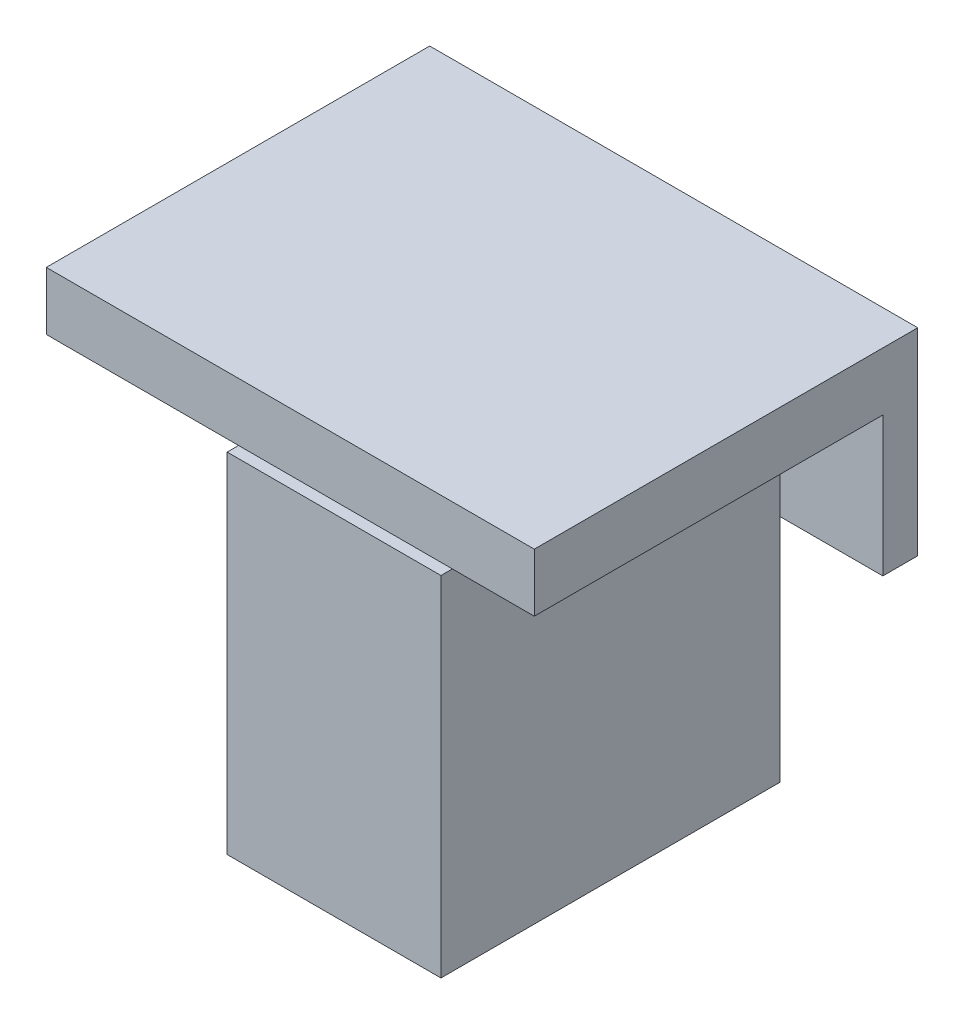
ISO-10303-21;
HEADER;
FILE_DESCRIPTION(('STEP AP214'),'2;1');
FILE_NAME('part.step','',(''),(''),'','','');
FILE_SCHEMA(('AUTOMOTIVE_DESIGN { 1 0 10303 214 1 1 1 1 }'));
ENDSEC;
DATA;
#1=APPLICATION_CONTEXT('core data for automotive mechanical design processes');
#2=APPLICATION_PROTOCOL_DEFINITION('international standard','automotive_design',2000,#1);
#3=PRODUCT_CONTEXT('',#1,'mechanical');
#4=PRODUCT('Part','Part','',(#3));
#5=PRODUCT_RELATED_PRODUCT_CATEGORY('part','',(#4));
#6=PRODUCT_DEFINITION_FORMATION('','',#4);
#7=PRODUCT_DEFINITION_CONTEXT('part definition',#1,'design');
#8=PRODUCT_DEFINITION('design','',#6,#7);
#9=PRODUCT_DEFINITION_SHAPE('','',#8);
#10=(LENGTH_UNIT() NAMED_UNIT(*) SI_UNIT(.MILLI.,.METRE.));
#11=(NAMED_UNIT(*) PLANE_ANGLE_UNIT() SI_UNIT($,.RADIAN.));
#12=(NAMED_UNIT(*) SI_UNIT($,.STERADIAN.) SOLID_ANGLE_UNIT());
#13=UNCERTAINTY_MEASURE_WITH_UNIT(LENGTH_MEASURE(1.E-05),#10,'distance_accuracy_value','');
#14=(GEOMETRIC_REPRESENTATION_CONTEXT(3) GLOBAL_UNCERTAINTY_ASSIGNED_CONTEXT((#13)) GLOBAL_UNIT_ASSIGNED_CONTEXT((#10,
#11,#12)) REPRESENTATION_CONTEXT('',''));
#15=CARTESIAN_POINT('',(0.,0.,0.));
#16=DIRECTION('',(0.,0.,1.));
#17=DIRECTION('',(1.,0.,0.));
#18=AXIS2_PLACEMENT_3D('',#15,#16,#17);
#19=CARTESIAN_POINT('',(42.,-5.,33.));
#20=DIRECTION('',(0.,1.,0.));
#21=DIRECTION('',(-1.,0.,0.));
#22=AXIS2_PLACEMENT_3D('',#19,#20,#21);
#23=PLANE('',#22);
#24=DIRECTION('',(0.,0.,1.));
#25=VECTOR('',#24,1.);
#26=CARTESIAN_POINT('',(34.9498285382595,-5.,4.78266874465594));
#27=LINE('',#26,#25);
#28=CARTESIAN_POINT('',(34.9498285382595,-5.,4.78266874465594));
#29=VERTEX_POINT('',#28);
#30=CARTESIAN_POINT('',(34.9498285382595,-5.,33.));
#31=VERTEX_POINT('',#30);
#32=EDGE_CURVE('E58',#29,#31,#27,.T.);
#33=ORIENTED_EDGE('',*,*,#32,.F.);
#34=DIRECTION('',(1.,0.,0.));
#35=VECTOR('',#34,1.);
#36=CARTESIAN_POINT('',(34.9498285382595,-5.,4.78266874465594));
#37=LINE('',#36,#35);
#38=CARTESIAN_POINT('',(16.5498285382595,-5.,4.78266874465594));
#39=VERTEX_POINT('',#38);
#40=EDGE_CURVE('E188',#39,#29,#37,.T.);
#41=ORIENTED_EDGE('',*,*,#40,.F.);
#42=DIRECTION('',(0.,0.,-1.));
#43=VECTOR('',#42,1.);
#44=CARTESIAN_POINT('',(16.5498285382595,-5.,4.78266874465594));
#45=LINE('',#44,#43);
#46=CARTESIAN_POINT('',(16.5498285382595,-5.,33.));
#47=VERTEX_POINT('',#46);
#48=EDGE_CURVE('E198',#47,#39,#45,.T.);
#49=ORIENTED_EDGE('',*,*,#48,.F.);
#50=DIRECTION('',(1.,0.,0.));
#51=VECTOR('',#50,1.);
#52=CARTESIAN_POINT('',(42.,-5.,33.));
#53=LINE('',#52,#51);
#54=CARTESIAN_POINT('',(0.,-5.00000000000001,33.));
#55=VERTEX_POINT('',#54);
#56=EDGE_CURVE('E223',#55,#47,#53,.T.);
#57=ORIENTED_EDGE('',*,*,#56,.F.);
#58=DIRECTION('',(0.,0.,-1.));
#59=VECTOR('',#58,1.);
#60=CARTESIAN_POINT('',(0.,-5.00000000000001,33.));
#61=LINE('',#60,#59);
#62=CARTESIAN_POINT('',(0.,-5.,3.));
#63=VERTEX_POINT('',#62);
#64=EDGE_CURVE('E232',#55,#63,#61,.T.);
#65=ORIENTED_EDGE('',*,*,#64,.T.);
#66=DIRECTION('',(1.,0.,0.));
#67=VECTOR('',#66,1.);
#68=CARTESIAN_POINT('',(42.,-5.,3.));
#69=LINE('',#68,#67);
#70=CARTESIAN_POINT('',(42.,-5.,3.));
#71=VERTEX_POINT('',#70);
#72=EDGE_CURVE('E213',#63,#71,#69,.T.);
#73=ORIENTED_EDGE('',*,*,#72,.T.);
#74=DIRECTION('',(0.,0.,-1.));
#75=VECTOR('',#74,1.);
#76=CARTESIAN_POINT('',(42.,-5.,33.));
#77=LINE('',#76,#75);
#78=CARTESIAN_POINT('',(42.,-5.,33.));
#79=VERTEX_POINT('',#78);
#80=EDGE_CURVE('E226',#79,#71,#77,.T.);
#81=ORIENTED_EDGE('',*,*,#80,.F.);
#82=EDGE_CURVE('E222',#31,#79,#53,.T.);
#83=ORIENTED_EDGE('',*,*,#82,.F.);
#84=EDGE_LOOP('',(#33,#41,#49,#57,#65,#73,#81,#83));
#85=FACE_BOUND('',#84,.T.);
#86=ADVANCED_FACE('F35',(#85),#23,.F.);
#87=CARTESIAN_POINT('',(0.,0.,3.));
#88=DIRECTION('',(1.,0.,0.));
#89=DIRECTION('',(0.,1.,0.));
#90=AXIS2_PLACEMENT_3D('',#87,#88,#89);
#91=PLANE('',#90);
#92=DIRECTION('',(0.,-1.,0.));
#93=VECTOR('',#92,1.);
#94=CARTESIAN_POINT('',(0.,0.,0.));
#95=LINE('',#94,#93);
#96=CARTESIAN_POINT('',(0.,0.,0.));
#97=VERTEX_POINT('',#96);
#98=CARTESIAN_POINT('',(0.,-17.,0.));
#99=VERTEX_POINT('',#98);
#100=EDGE_CURVE('E239',#97,#99,#95,.T.);
#101=ORIENTED_EDGE('',*,*,#100,.T.);
#102=DIRECTION('',(0.,0.,-1.));
#103=VECTOR('',#102,1.);
#104=CARTESIAN_POINT('',(0.,-17.,3.));
#105=LINE('',#104,#103);
#106=CARTESIAN_POINT('',(0.,-17.,3.));
#107=VERTEX_POINT('',#106);
#108=EDGE_CURVE('E11',#107,#99,#105,.T.);
#109=ORIENTED_EDGE('',*,*,#108,.F.);
#110=DIRECTION('',(0.,-1.,0.));
#111=VECTOR('',#110,1.);
#112=CARTESIAN_POINT('',(0.,0.,3.));
#113=LINE('',#112,#111);
#114=EDGE_CURVE('E248',#63,#107,#113,.T.);
#115=ORIENTED_EDGE('',*,*,#114,.F.);
#116=ORIENTED_EDGE('',*,*,#64,.F.);
#117=DIRECTION('',(0.,-1.,0.));
#118=VECTOR('',#117,1.);
#119=CARTESIAN_POINT('',(0.,0.,33.));
#120=LINE('',#119,#118);
#121=CARTESIAN_POINT('',(0.,0.,33.));
#122=VERTEX_POINT('',#121);
#123=EDGE_CURVE('E220',#122,#55,#120,.T.);
#124=ORIENTED_EDGE('',*,*,#123,.F.);
#125=DIRECTION('',(0.,0.,-1.));
#126=VECTOR('',#125,1.);
#127=CARTESIAN_POINT('',(0.,0.,3.));
#128=LINE('',#127,#126);
#129=EDGE_CURVE('E255',#122,#97,#128,.T.);
#130=ORIENTED_EDGE('',*,*,#129,.T.);
#131=EDGE_LOOP('',(#101,#109,#115,#116,#124,#130));
#132=FACE_BOUND('',#131,.T.);
#133=ADVANCED_FACE('F37',(#132),#91,.F.);
#134=CARTESIAN_POINT('',(0.,-17.,3.));
#135=DIRECTION('',(0.,1.,0.));
#136=DIRECTION('',(0.,0.,1.));
#137=AXIS2_PLACEMENT_3D('',#134,#135,#136);
#138=PLANE('',#137);
#139=DIRECTION('',(1.,0.,0.));
#140=VECTOR('',#139,1.);
#141=CARTESIAN_POINT('',(0.,-17.,0.));
#142=LINE('',#141,#140);
#143=CARTESIAN_POINT('',(42.,-17.,0.));
#144=VERTEX_POINT('',#143);
#145=EDGE_CURVE('E258',#99,#144,#142,.T.);
#146=ORIENTED_EDGE('',*,*,#145,.T.);
#147=DIRECTION('',(0.,0.,-1.));
#148=VECTOR('',#147,1.);
#149=CARTESIAN_POINT('',(42.,-17.,3.));
#150=LINE('',#149,#148);
#151=CARTESIAN_POINT('',(42.,-17.,3.));
#152=VERTEX_POINT('',#151);
#153=EDGE_CURVE('E43',#152,#144,#150,.T.);
#154=ORIENTED_EDGE('',*,*,#153,.F.);
#155=DIRECTION('',(1.,0.,0.));
#156=VECTOR('',#155,1.);
#157=CARTESIAN_POINT('',(0.,-17.,3.));
#158=LINE('',#157,#156);
#159=EDGE_CURVE('E250',#107,#152,#158,.T.);
#160=ORIENTED_EDGE('',*,*,#159,.F.);
#161=ORIENTED_EDGE('',*,*,#108,.T.);
#162=EDGE_LOOP('',(#146,#154,#160,#161));
#163=FACE_BOUND('',#162,.T.);
#164=ADVANCED_FACE('F298',(#163),#138,.F.);
#165=CARTESIAN_POINT('',(42.,0.,3.));
#166=DIRECTION('',(-1.,0.,0.));
#167=DIRECTION('',(0.,-1.,0.));
#168=AXIS2_PLACEMENT_3D('',#165,#166,#167);
#169=PLANE('',#168);
#170=DIRECTION('',(0.,1.,0.));
#171=VECTOR('',#170,1.);
#172=CARTESIAN_POINT('',(42.,0.,0.));
#173=LINE('',#172,#171);
#174=CARTESIAN_POINT('',(42.,0.,0.));
#175=VERTEX_POINT('',#174);
#176=EDGE_CURVE('E260',#144,#175,#173,.T.);
#177=ORIENTED_EDGE('',*,*,#176,.T.);
#178=DIRECTION('',(0.,0.,-1.));
#179=VECTOR('',#178,1.);
#180=CARTESIAN_POINT('',(42.,0.,3.));
#181=LINE('',#180,#179);
#182=CARTESIAN_POINT('',(42.,0.,33.));
#183=VERTEX_POINT('',#182);
#184=EDGE_CURVE('E265',#183,#175,#181,.T.);
#185=ORIENTED_EDGE('',*,*,#184,.F.);
#186=DIRECTION('',(0.,1.,0.));
#187=VECTOR('',#186,1.);
#188=CARTESIAN_POINT('',(42.,0.,33.));
#189=LINE('',#188,#187);
#190=EDGE_CURVE('E214',#79,#183,#189,.T.);
#191=ORIENTED_EDGE('',*,*,#190,.F.);
#192=ORIENTED_EDGE('',*,*,#80,.T.);
#193=DIRECTION('',(0.,1.,0.));
#194=VECTOR('',#193,1.);
#195=CARTESIAN_POINT('',(42.,0.,3.));
#196=LINE('',#195,#194);
#197=EDGE_CURVE('E253',#152,#71,#196,.T.);
#198=ORIENTED_EDGE('',*,*,#197,.F.);
#199=ORIENTED_EDGE('',*,*,#153,.T.);
#200=EDGE_LOOP('',(#177,#185,#191,#192,#198,#199));
#201=FACE_BOUND('',#200,.T.);
#202=ADVANCED_FACE('F272',(#201),#169,.F.);
#203=CARTESIAN_POINT('',(0.,0.,3.));
#204=DIRECTION('',(0.,-1.,0.));
#205=DIRECTION('',(0.,0.,-1.));
#206=AXIS2_PLACEMENT_3D('',#203,#204,#205);
#207=PLANE('',#206);
#208=DIRECTION('',(-1.,0.,0.));
#209=VECTOR('',#208,1.);
#210=CARTESIAN_POINT('',(0.,0.,0.));
#211=LINE('',#210,#209);
#212=EDGE_CURVE('E251',#175,#97,#211,.T.);
#213=ORIENTED_EDGE('',*,*,#212,.T.);
#214=ORIENTED_EDGE('',*,*,#129,.F.);
#215=DIRECTION('',(-1.,0.,0.));
#216=VECTOR('',#215,1.);
#217=CARTESIAN_POINT('',(42.,0.,33.));
#218=LINE('',#217,#216);
#219=EDGE_CURVE('E217',#183,#122,#218,.T.);
#220=ORIENTED_EDGE('',*,*,#219,.F.);
#221=ORIENTED_EDGE('',*,*,#184,.T.);
#222=EDGE_LOOP('',(#213,#214,#220,#221));
#223=FACE_BOUND('',#222,.T.);
#224=ADVANCED_FACE('F280',(#223),#207,.F.);
#225=CARTESIAN_POINT('',(0.,0.,3.));
#226=DIRECTION('',(0.,0.,1.));
#227=DIRECTION('',(1.,0.,0.));
#228=AXIS2_PLACEMENT_3D('',#225,#226,#227);
#229=PLANE('',#228);
#230=ORIENTED_EDGE('',*,*,#72,.F.);
#231=ORIENTED_EDGE('',*,*,#114,.T.);
#232=ORIENTED_EDGE('',*,*,#159,.T.);
#233=ORIENTED_EDGE('',*,*,#197,.T.);
#234=EDGE_LOOP('',(#230,#231,#232,#233));
#235=FACE_BOUND('',#234,.T.);
#236=CARTESIAN_POINT('',(6.,-8.5,3.));
#237=DIRECTION('',(0.,0.,1.));
#238=DIRECTION('',(1.,0.,0.));
#239=AXIS2_PLACEMENT_3D('',#236,#237,#238);
#240=CIRCLE('',#239,1.625);
#241=CARTESIAN_POINT('',(7.625,-8.5,3.));
#242=VERTEX_POINT('',#241);
#243=EDGE_CURVE('E240',#242,#242,#240,.T.);
#244=ORIENTED_EDGE('',*,*,#243,.F.);
#245=EDGE_LOOP('',(#244));
#246=FACE_BOUND('',#245,.T.);
#247=CARTESIAN_POINT('',(36.,-8.5,3.));
#248=DIRECTION('',(0.,0.,1.));
#249=DIRECTION('',(1.,0.,0.));
#250=AXIS2_PLACEMENT_3D('',#247,#248,#249);
#251=CIRCLE('',#250,1.625);
#252=CARTESIAN_POINT('',(37.625,-8.5,3.));
#253=VERTEX_POINT('',#252);
#254=EDGE_CURVE('E235',#253,#253,#251,.T.);
#255=ORIENTED_EDGE('',*,*,#254,.F.);
#256=EDGE_LOOP('',(#255));
#257=FACE_BOUND('',#256,.T.);
#258=ADVANCED_FACE('F296',(#235,#246,#257),#229,.T.);
#259=CARTESIAN_POINT('',(0.,0.,0.));
#260=DIRECTION('',(0.,0.,1.));
#261=DIRECTION('',(1.,0.,0.));
#262=AXIS2_PLACEMENT_3D('',#259,#260,#261);
#263=PLANE('',#262);
#264=CARTESIAN_POINT('',(6.,-8.5,0.));
#265=DIRECTION('',(0.,0.,1.));
#266=DIRECTION('',(1.,0.,0.));
#267=AXIS2_PLACEMENT_3D('',#264,#265,#266);
#268=CIRCLE('',#267,1.625);
#269=CARTESIAN_POINT('',(7.625,-8.5,0.));
#270=VERTEX_POINT('',#269);
#271=EDGE_CURVE('E236',#270,#270,#268,.T.);
#272=ORIENTED_EDGE('',*,*,#271,.T.);
#273=EDGE_LOOP('',(#272));
#274=FACE_BOUND('',#273,.T.);
#275=CARTESIAN_POINT('',(36.,-8.5,0.));
#276=DIRECTION('',(0.,0.,1.));
#277=DIRECTION('',(1.,0.,0.));
#278=AXIS2_PLACEMENT_3D('',#275,#276,#277);
#279=CIRCLE('',#278,1.625);
#280=CARTESIAN_POINT('',(37.625,-8.5,0.));
#281=VERTEX_POINT('',#280);
#282=EDGE_CURVE('E243',#281,#281,#279,.T.);
#283=ORIENTED_EDGE('',*,*,#282,.T.);
#284=EDGE_LOOP('',(#283));
#285=FACE_BOUND('',#284,.T.);
#286=ORIENTED_EDGE('',*,*,#100,.F.);
#287=ORIENTED_EDGE('',*,*,#212,.F.);
#288=ORIENTED_EDGE('',*,*,#176,.F.);
#289=ORIENTED_EDGE('',*,*,#145,.F.);
#290=EDGE_LOOP('',(#286,#287,#288,#289));
#291=FACE_BOUND('',#290,.T.);
#292=ADVANCED_FACE('F278',(#274,#285,#291),#263,.F.);
#293=CARTESIAN_POINT('',(36.,-8.5,0.));
#294=DIRECTION('',(0.,0.,1.));
#295=DIRECTION('',(1.,0.,0.));
#296=AXIS2_PLACEMENT_3D('',#293,#294,#295);
#297=CYLINDRICAL_SURFACE('',#296,1.625);
#298=ORIENTED_EDGE('',*,*,#282,.F.);
#299=EDGE_LOOP('',(#298));
#300=FACE_BOUND('',#299,.T.);
#301=ORIENTED_EDGE('',*,*,#254,.T.);
#302=EDGE_LOOP('',(#301));
#303=FACE_BOUND('',#302,.T.);
#304=ADVANCED_FACE('F357',(#300,#303),#297,.F.);
#305=CARTESIAN_POINT('',(6.,-8.5,0.));
#306=DIRECTION('',(0.,0.,1.));
#307=DIRECTION('',(1.,0.,0.));
#308=AXIS2_PLACEMENT_3D('',#305,#306,#307);
#309=CYLINDRICAL_SURFACE('',#308,1.625);
#310=ORIENTED_EDGE('',*,*,#271,.F.);
#311=EDGE_LOOP('',(#310));
#312=FACE_BOUND('',#311,.T.);
#313=ORIENTED_EDGE('',*,*,#243,.T.);
#314=EDGE_LOOP('',(#313));
#315=FACE_BOUND('',#314,.T.);
#316=ADVANCED_FACE('F353',(#312,#315),#309,.F.);
#317=CARTESIAN_POINT('',(0.,0.,33.));
#318=DIRECTION('',(0.,0.,-1.));
#319=DIRECTION('',(-1.,0.,0.));
#320=AXIS2_PLACEMENT_3D('',#317,#318,#319);
#321=PLANE('',#320);
#322=ORIENTED_EDGE('',*,*,#190,.T.);
#323=ORIENTED_EDGE('',*,*,#219,.T.);
#324=ORIENTED_EDGE('',*,*,#123,.T.);
#325=ORIENTED_EDGE('',*,*,#56,.T.);
#326=EDGE_CURVE('E227',#47,#31,#53,.T.);
#327=ORIENTED_EDGE('',*,*,#326,.T.);
#328=ORIENTED_EDGE('',*,*,#82,.T.);
#329=EDGE_LOOP('',(#322,#323,#324,#325,#327,#328));
#330=FACE_BOUND('',#329,.T.);
#331=ADVANCED_FACE('F289',(#330),#321,.F.);
#332=CARTESIAN_POINT('',(0.,-5.00000000000001,0.));
#333=DIRECTION('',(0.,-1.,0.));
#334=DIRECTION('',(1.,0.,0.));
#335=AXIS2_PLACEMENT_3D('',#332,#333,#334);
#336=PLANE('',#335);
#337=CARTESIAN_POINT('',(34.9498285382595,-5.,33.9826687446559));
#338=VERTEX_POINT('',#337);
#339=EDGE_CURVE('E160',#31,#338,#27,.T.);
#340=ORIENTED_EDGE('',*,*,#339,.F.);
#341=ORIENTED_EDGE('',*,*,#326,.F.);
#342=CARTESIAN_POINT('',(16.5498285382595,-5.,33.9826687446559));
#343=VERTEX_POINT('',#342);
#344=EDGE_CURVE('E199',#343,#47,#45,.T.);
#345=ORIENTED_EDGE('',*,*,#344,.F.);
#346=DIRECTION('',(-1.,0.,0.));
#347=VECTOR('',#346,1.);
#348=CARTESIAN_POINT('',(34.9498285382595,-5.,33.9826687446559));
#349=LINE('',#348,#347);
#350=EDGE_CURVE('E196',#338,#343,#349,.T.);
#351=ORIENTED_EDGE('',*,*,#350,.F.);
#352=EDGE_LOOP('',(#340,#341,#345,#351));
#353=FACE_BOUND('',#352,.T.);
#354=ADVANCED_FACE('F335',(#353),#336,.F.);
#355=CARTESIAN_POINT('',(0.,-35.,0.));
#356=DIRECTION('',(0.,-1.,0.));
#357=DIRECTION('',(1.,0.,0.));
#358=AXIS2_PLACEMENT_3D('',#355,#356,#357);
#359=PLANE('',#358);
#360=DIRECTION('',(0.,0.,1.));
#361=VECTOR('',#360,1.);
#362=CARTESIAN_POINT('',(34.9498285382595,-35.,4.78266874465594));
#363=LINE('',#362,#361);
#364=CARTESIAN_POINT('',(34.9498285382595,-35.,4.78266874465594));
#365=VERTEX_POINT('',#364);
#366=CARTESIAN_POINT('',(34.9498285382595,-35.,33.9826687446559));
#367=VERTEX_POINT('',#366);
#368=EDGE_CURVE('E184',#365,#367,#363,.T.);
#369=ORIENTED_EDGE('',*,*,#368,.T.);
#370=DIRECTION('',(-1.,0.,0.));
#371=VECTOR('',#370,1.);
#372=CARTESIAN_POINT('',(34.9498285382595,-35.,33.9826687446559));
#373=LINE('',#372,#371);
#374=CARTESIAN_POINT('',(16.5498285382595,-35.,33.9826687446559));
#375=VERTEX_POINT('',#374);
#376=EDGE_CURVE('E187',#367,#375,#373,.T.);
#377=ORIENTED_EDGE('',*,*,#376,.T.);
#378=DIRECTION('',(0.,0.,-1.));
#379=VECTOR('',#378,1.);
#380=CARTESIAN_POINT('',(16.5498285382595,-35.,4.78266874465594));
#381=LINE('',#380,#379);
#382=CARTESIAN_POINT('',(16.5498285382595,-35.,4.78266874465594));
#383=VERTEX_POINT('',#382);
#384=EDGE_CURVE('E190',#375,#383,#381,.T.);
#385=ORIENTED_EDGE('',*,*,#384,.T.);
#386=DIRECTION('',(1.,0.,0.));
#387=VECTOR('',#386,1.);
#388=CARTESIAN_POINT('',(34.9498285382595,-35.,4.78266874465594));
#389=LINE('',#388,#387);
#390=EDGE_CURVE('E192',#383,#365,#389,.T.);
#391=ORIENTED_EDGE('',*,*,#390,.T.);
#392=EDGE_LOOP('',(#369,#377,#385,#391));
#393=FACE_BOUND('',#392,.T.);
#394=DIRECTION('',(-1.,0.,0.));
#395=VECTOR('',#394,1.);
#396=CARTESIAN_POINT('',(31.9498285382595,-35.,30.9826687446559));
#397=LINE('',#396,#395);
#398=CARTESIAN_POINT('',(31.9498285382595,-35.,30.9826687446559));
#399=VERTEX_POINT('',#398);
#400=CARTESIAN_POINT('',(19.5498285382595,-35.,30.9826687446559));
#401=VERTEX_POINT('',#400);
#402=EDGE_CURVE('E152',#399,#401,#397,.T.);
#403=ORIENTED_EDGE('',*,*,#402,.F.);
#404=DIRECTION('',(0.,0.,1.));
#405=VECTOR('',#404,1.);
#406=CARTESIAN_POINT('',(31.9498285382595,-35.,7.78266874465594));
#407=LINE('',#406,#405);
#408=CARTESIAN_POINT('',(31.9498285382595,-35.,7.78266874465594));
#409=VERTEX_POINT('',#408);
#410=EDGE_CURVE('E144',#409,#399,#407,.T.);
#411=ORIENTED_EDGE('',*,*,#410,.F.);
#412=DIRECTION('',(1.,0.,0.));
#413=VECTOR('',#412,1.);
#414=CARTESIAN_POINT('',(31.9498285382595,-35.,7.78266874465594));
#415=LINE('',#414,#413);
#416=CARTESIAN_POINT('',(19.5498285382594,-35.,7.78266874465594));
#417=VERTEX_POINT('',#416);
#418=EDGE_CURVE('E168',#417,#409,#415,.T.);
#419=ORIENTED_EDGE('',*,*,#418,.F.);
#420=DIRECTION('',(0.,0.,-1.));
#421=VECTOR('',#420,1.);
#422=CARTESIAN_POINT('',(19.5498285382595,-35.,7.78266874465594));
#423=LINE('',#422,#421);
#424=EDGE_CURVE('E166',#401,#417,#423,.T.);
#425=ORIENTED_EDGE('',*,*,#424,.F.);
#426=EDGE_LOOP('',(#403,#411,#419,#425));
#427=FACE_BOUND('',#426,.T.);
#428=ADVANCED_FACE('F164',(#393,#427),#359,.T.);
#429=CARTESIAN_POINT('',(34.9498285382595,-35.,4.78266874465594));
#430=DIRECTION('',(-1.,0.,0.));
#431=DIRECTION('',(0.,-1.,0.));
#432=AXIS2_PLACEMENT_3D('',#429,#430,#431);
#433=PLANE('',#432);
#434=ORIENTED_EDGE('',*,*,#32,.T.);
#435=ORIENTED_EDGE('',*,*,#339,.T.);
#436=DIRECTION('',(0.,1.,0.));
#437=VECTOR('',#436,1.);
#438=CARTESIAN_POINT('',(34.9498285382595,-35.,33.9826687446559));
#439=LINE('',#438,#437);
#440=EDGE_CURVE('E210',#367,#338,#439,.T.);
#441=ORIENTED_EDGE('',*,*,#440,.F.);
#442=ORIENTED_EDGE('',*,*,#368,.F.);
#443=DIRECTION('',(0.,1.,0.));
#444=VECTOR('',#443,1.);
#445=CARTESIAN_POINT('',(34.9498285382595,-35.,4.78266874465594));
#446=LINE('',#445,#444);
#447=EDGE_CURVE('E194',#365,#29,#446,.T.);
#448=ORIENTED_EDGE('',*,*,#447,.T.);
#449=EDGE_LOOP('',(#434,#435,#441,#442,#448));
#450=FACE_BOUND('',#449,.T.);
#451=ADVANCED_FACE('F334',(#450),#433,.F.);
#452=CARTESIAN_POINT('',(34.9498285382595,-35.,33.9826687446559));
#453=DIRECTION('',(0.,0.,-1.));
#454=DIRECTION('',(-1.,0.,0.));
#455=AXIS2_PLACEMENT_3D('',#452,#453,#454);
#456=PLANE('',#455);
#457=ORIENTED_EDGE('',*,*,#350,.T.);
#458=DIRECTION('',(0.,1.,0.));
#459=VECTOR('',#458,1.);
#460=CARTESIAN_POINT('',(16.5498285382595,-35.,33.9826687446559));
#461=LINE('',#460,#459);
#462=EDGE_CURVE('E207',#375,#343,#461,.T.);
#463=ORIENTED_EDGE('',*,*,#462,.F.);
#464=ORIENTED_EDGE('',*,*,#376,.F.);
#465=ORIENTED_EDGE('',*,*,#440,.T.);
#466=EDGE_LOOP('',(#457,#463,#464,#465));
#467=FACE_BOUND('',#466,.T.);
#468=ADVANCED_FACE('F346',(#467),#456,.F.);
#469=CARTESIAN_POINT('',(16.5498285382595,-35.,4.78266874465594));
#470=DIRECTION('',(1.,0.,0.));
#471=DIRECTION('',(0.,1.,0.));
#472=AXIS2_PLACEMENT_3D('',#469,#470,#471);
#473=PLANE('',#472);
#474=ORIENTED_EDGE('',*,*,#344,.T.);
#475=ORIENTED_EDGE('',*,*,#48,.T.);
#476=DIRECTION('',(0.,1.,0.));
#477=VECTOR('',#476,1.);
#478=CARTESIAN_POINT('',(16.5498285382595,-35.,4.78266874465594));
#479=LINE('',#478,#477);
#480=EDGE_CURVE('E204',#383,#39,#479,.T.);
#481=ORIENTED_EDGE('',*,*,#480,.F.);
#482=ORIENTED_EDGE('',*,*,#384,.F.);
#483=ORIENTED_EDGE('',*,*,#462,.T.);
#484=EDGE_LOOP('',(#474,#475,#481,#482,#483));
#485=FACE_BOUND('',#484,.T.);
#486=ADVANCED_FACE('F342',(#485),#473,.F.);
#487=CARTESIAN_POINT('',(34.9498285382595,-35.,4.78266874465594));
#488=DIRECTION('',(0.,0.,1.));
#489=DIRECTION('',(1.,0.,0.));
#490=AXIS2_PLACEMENT_3D('',#487,#488,#489);
#491=PLANE('',#490);
#492=ORIENTED_EDGE('',*,*,#40,.T.);
#493=ORIENTED_EDGE('',*,*,#447,.F.);
#494=ORIENTED_EDGE('',*,*,#390,.F.);
#495=ORIENTED_EDGE('',*,*,#480,.T.);
#496=EDGE_LOOP('',(#492,#493,#494,#495));
#497=FACE_BOUND('',#496,.T.);
#498=ADVANCED_FACE('F331',(#497),#491,.F.);
#499=CARTESIAN_POINT('',(31.9498285382595,-35.,7.78266874465594));
#500=DIRECTION('',(-1.,0.,0.));
#501=DIRECTION('',(0.,-1.,0.));
#502=AXIS2_PLACEMENT_3D('',#499,#500,#501);
#503=PLANE('',#502);
#504=DIRECTION('',(0.,0.,1.));
#505=VECTOR('',#504,1.);
#506=CARTESIAN_POINT('',(31.9498285382594,-5.,7.78266874465594));
#507=LINE('',#506,#505);
#508=CARTESIAN_POINT('',(31.9498285382595,-5.,7.78266874465594));
#509=VERTEX_POINT('',#508);
#510=CARTESIAN_POINT('',(31.9498285382594,-5.,30.9826687446559));
#511=VERTEX_POINT('',#510);
#512=EDGE_CURVE('E172',#509,#511,#507,.T.);
#513=ORIENTED_EDGE('',*,*,#512,.F.);
#514=DIRECTION('',(0.,1.,0.));
#515=VECTOR('',#514,1.);
#516=CARTESIAN_POINT('',(31.9498285382595,-35.,7.78266874465594));
#517=LINE('',#516,#515);
#518=EDGE_CURVE('E50',#409,#509,#517,.T.);
#519=ORIENTED_EDGE('',*,*,#518,.F.);
#520=ORIENTED_EDGE('',*,*,#410,.T.);
#521=DIRECTION('',(0.,1.,0.));
#522=VECTOR('',#521,1.);
#523=CARTESIAN_POINT('',(31.9498285382595,-35.,30.9826687446559));
#524=LINE('',#523,#522);
#525=EDGE_CURVE('E147',#399,#511,#524,.T.);
#526=ORIENTED_EDGE('',*,*,#525,.T.);
#527=EDGE_LOOP('',(#513,#519,#520,#526));
#528=FACE_BOUND('',#527,.T.);
#529=ADVANCED_FACE('F146',(#528),#503,.T.);
#530=CARTESIAN_POINT('',(31.9498285382595,-35.,30.9826687446559));
#531=DIRECTION('',(0.,0.,-1.));
#532=DIRECTION('',(-1.,0.,0.));
#533=AXIS2_PLACEMENT_3D('',#530,#531,#532);
#534=PLANE('',#533);
#535=DIRECTION('',(-1.,0.,0.));
#536=VECTOR('',#535,1.);
#537=CARTESIAN_POINT('',(31.9498285382594,-5.,30.9826687446559));
#538=LINE('',#537,#536);
#539=CARTESIAN_POINT('',(19.5498285382594,-5.,30.9826687446559));
#540=VERTEX_POINT('',#539);
#541=EDGE_CURVE('E159',#511,#540,#538,.T.);
#542=ORIENTED_EDGE('',*,*,#541,.F.);
#543=ORIENTED_EDGE('',*,*,#525,.F.);
#544=ORIENTED_EDGE('',*,*,#402,.T.);
#545=DIRECTION('',(0.,1.,0.));
#546=VECTOR('',#545,1.);
#547=CARTESIAN_POINT('',(19.5498285382595,-35.,30.9826687446559));
#548=LINE('',#547,#546);
#549=EDGE_CURVE('E161',#401,#540,#548,.T.);
#550=ORIENTED_EDGE('',*,*,#549,.T.);
#551=EDGE_LOOP('',(#542,#543,#544,#550));
#552=FACE_BOUND('',#551,.T.);
#553=ADVANCED_FACE('F156',(#552),#534,.T.);
#554=CARTESIAN_POINT('',(19.5498285382595,-35.,7.78266874465594));
#555=DIRECTION('',(1.,0.,0.));
#556=DIRECTION('',(0.,1.,0.));
#557=AXIS2_PLACEMENT_3D('',#554,#555,#556);
#558=PLANE('',#557);
#559=DIRECTION('',(0.,0.,-1.));
#560=VECTOR('',#559,1.);
#561=CARTESIAN_POINT('',(19.5498285382594,-5.,7.78266874465594));
#562=LINE('',#561,#560);
#563=CARTESIAN_POINT('',(19.5498285382594,-5.,7.78266874465594));
#564=VERTEX_POINT('',#563);
#565=EDGE_CURVE('E175',#540,#564,#562,.T.);
#566=ORIENTED_EDGE('',*,*,#565,.F.);
#567=ORIENTED_EDGE('',*,*,#549,.F.);
#568=ORIENTED_EDGE('',*,*,#424,.T.);
#569=DIRECTION('',(0.,1.,0.));
#570=VECTOR('',#569,1.);
#571=CARTESIAN_POINT('',(19.5498285382595,-35.,7.78266874465594));
#572=LINE('',#571,#570);
#573=EDGE_CURVE('E181',#417,#564,#572,.T.);
#574=ORIENTED_EDGE('',*,*,#573,.T.);
#575=EDGE_LOOP('',(#566,#567,#568,#574));
#576=FACE_BOUND('',#575,.T.);
#577=ADVANCED_FACE('F318',(#576),#558,.T.);
#578=CARTESIAN_POINT('',(31.9498285382595,-35.,7.78266874465594));
#579=DIRECTION('',(0.,0.,1.));
#580=DIRECTION('',(1.,0.,0.));
#581=AXIS2_PLACEMENT_3D('',#578,#579,#580);
#582=PLANE('',#581);
#583=DIRECTION('',(1.,0.,0.));
#584=VECTOR('',#583,1.);
#585=CARTESIAN_POINT('',(31.9498285382594,-5.,7.78266874465594));
#586=LINE('',#585,#584);
#587=EDGE_CURVE('E153',#564,#509,#586,.T.);
#588=ORIENTED_EDGE('',*,*,#587,.F.);
#589=ORIENTED_EDGE('',*,*,#573,.F.);
#590=ORIENTED_EDGE('',*,*,#418,.T.);
#591=ORIENTED_EDGE('',*,*,#518,.T.);
#592=EDGE_LOOP('',(#588,#589,#590,#591));
#593=FACE_BOUND('',#592,.T.);
#594=ADVANCED_FACE('F313',(#593),#582,.T.);
#595=ORIENTED_EDGE('',*,*,#587,.T.);
#596=ORIENTED_EDGE('',*,*,#512,.T.);
#597=ORIENTED_EDGE('',*,*,#541,.T.);
#598=ORIENTED_EDGE('',*,*,#565,.T.);
#599=EDGE_LOOP('',(#595,#596,#597,#598));
#600=FACE_BOUND('',#599,.T.);
#601=ADVANCED_FACE('F307',(#600),#23,.F.);
#602=CLOSED_SHELL('',(#86,#133,#164,#202,#224,#258,#292,#304,#316,#331,#354,#428,#451,#468,#486,
#498,#529,#553,#577,#594,#601));
#603=MANIFOLD_SOLID_BREP('B2',#602);
#604=ADVANCED_BREP_SHAPE_REPRESENTATION('',(#18,#603),#14);
#605=SHAPE_DEFINITION_REPRESENTATION(#9,#604);
ENDSEC;
END-ISO-10303-21;
